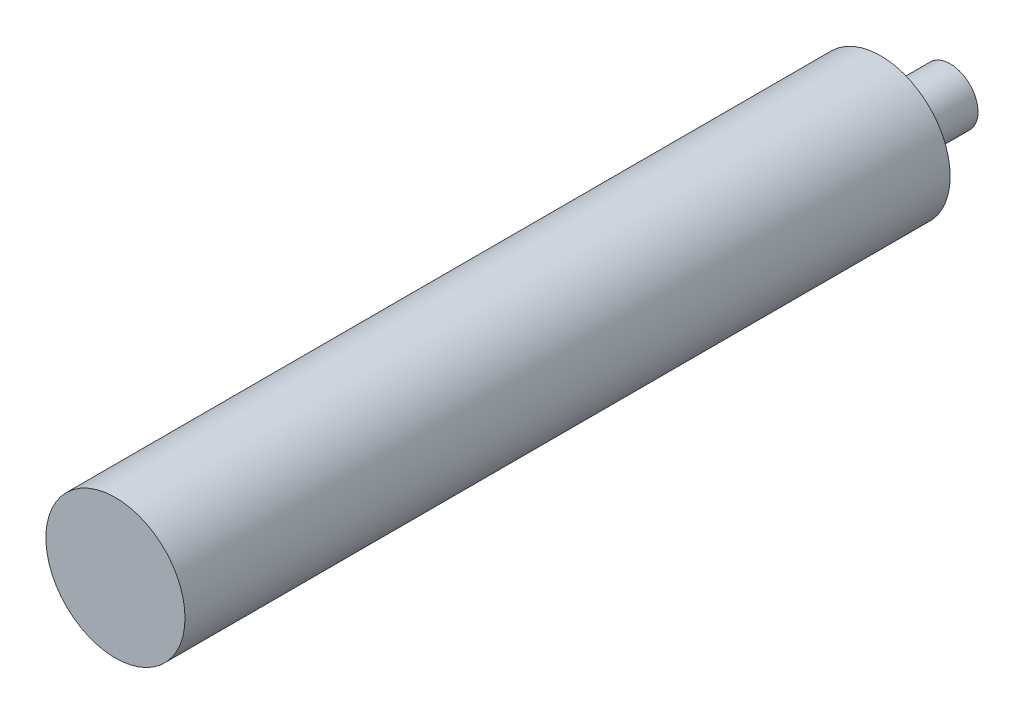
ISO-10303-21;
HEADER;
FILE_DESCRIPTION(('STEP AP214'),'2;1');
FILE_NAME('part.step','',(''),(''),'','','');
FILE_SCHEMA(('AUTOMOTIVE_DESIGN { 1 0 10303 214 1 1 1 1 }'));
ENDSEC;
DATA;
#1=APPLICATION_CONTEXT('core data for automotive mechanical design processes');
#2=APPLICATION_PROTOCOL_DEFINITION('international standard','automotive_design',2000,#1);
#3=PRODUCT_CONTEXT('',#1,'mechanical');
#4=PRODUCT('Part','Part','',(#3));
#5=PRODUCT_RELATED_PRODUCT_CATEGORY('part','',(#4));
#6=PRODUCT_DEFINITION_FORMATION('','',#4);
#7=PRODUCT_DEFINITION_CONTEXT('part definition',#1,'design');
#8=PRODUCT_DEFINITION('design','',#6,#7);
#9=PRODUCT_DEFINITION_SHAPE('','',#8);
#10=(LENGTH_UNIT() NAMED_UNIT(*) SI_UNIT(.MILLI.,.METRE.));
#11=(NAMED_UNIT(*) PLANE_ANGLE_UNIT() SI_UNIT($,.RADIAN.));
#12=(NAMED_UNIT(*) SI_UNIT($,.STERADIAN.) SOLID_ANGLE_UNIT());
#13=UNCERTAINTY_MEASURE_WITH_UNIT(LENGTH_MEASURE(1.E-05),#10,'distance_accuracy_value','');
#14=(GEOMETRIC_REPRESENTATION_CONTEXT(3) GLOBAL_UNCERTAINTY_ASSIGNED_CONTEXT((#13)) GLOBAL_UNIT_ASSIGNED_CONTEXT((#10,
#11,#12)) REPRESENTATION_CONTEXT('',''));
#15=CARTESIAN_POINT('',(0.,0.,0.));
#16=DIRECTION('',(0.,0.,1.));
#17=DIRECTION('',(1.,0.,0.));
#18=AXIS2_PLACEMENT_3D('',#15,#16,#17);
#19=CARTESIAN_POINT('',(0.,0.,5.));
#20=DIRECTION('',(0.,0.,-1.));
#21=DIRECTION('',(-1.,0.,0.));
#22=AXIS2_PLACEMENT_3D('',#19,#20,#21);
#23=CYLINDRICAL_SURFACE('',#22,2.);
#24=CARTESIAN_POINT('',(0.,0.,5.));
#25=DIRECTION('',(0.,0.,1.));
#26=DIRECTION('',(1.,0.,0.));
#27=AXIS2_PLACEMENT_3D('',#24,#25,#26);
#28=CIRCLE('',#27,2.);
#29=CARTESIAN_POINT('',(2.,0.,5.));
#30=VERTEX_POINT('',#29);
#31=EDGE_CURVE('E10',#30,#30,#28,.T.);
#32=ORIENTED_EDGE('',*,*,#31,.F.);
#33=EDGE_LOOP('',(#32));
#34=FACE_BOUND('',#33,.T.);
#35=CARTESIAN_POINT('',(0.,0.,0.));
#36=DIRECTION('',(0.,0.,1.));
#37=DIRECTION('',(1.,0.,0.));
#38=AXIS2_PLACEMENT_3D('',#35,#36,#37);
#39=CIRCLE('',#38,2.);
#40=CARTESIAN_POINT('',(2.,0.,0.));
#41=VERTEX_POINT('',#40);
#42=EDGE_CURVE('E33',#41,#41,#39,.T.);
#43=ORIENTED_EDGE('',*,*,#42,.T.);
#44=EDGE_LOOP('',(#43));
#45=FACE_BOUND('',#44,.T.);
#46=ADVANCED_FACE('F30',(#34,#45),#23,.T.);
#47=CARTESIAN_POINT('',(0.,0.,0.));
#48=DIRECTION('',(0.,0.,1.));
#49=DIRECTION('',(1.,0.,0.));
#50=AXIS2_PLACEMENT_3D('',#47,#48,#49);
#51=PLANE('',#50);
#52=ORIENTED_EDGE('',*,*,#42,.F.);
#53=EDGE_LOOP('',(#52));
#54=FACE_BOUND('',#53,.T.);
#55=ADVANCED_FACE('F58',(#54),#51,.F.);
#56=CARTESIAN_POINT('',(0.,0.,5.));
#57=DIRECTION('',(0.,0.,1.));
#58=DIRECTION('',(1.,0.,0.));
#59=AXIS2_PLACEMENT_3D('',#56,#57,#58);
#60=PLANE('',#59);
#61=CARTESIAN_POINT('',(0.,0.,5.));
#62=DIRECTION('',(0.,0.,1.));
#63=DIRECTION('',(1.,0.,0.));
#64=AXIS2_PLACEMENT_3D('',#61,#62,#63);
#65=CIRCLE('',#64,5.);
#66=CARTESIAN_POINT('',(5.,0.,5.));
#67=VERTEX_POINT('',#66);
#68=EDGE_CURVE('E42',#67,#67,#65,.T.);
#69=ORIENTED_EDGE('',*,*,#68,.F.);
#70=EDGE_LOOP('',(#69));
#71=FACE_BOUND('',#70,.T.);
#72=ORIENTED_EDGE('',*,*,#31,.T.);
#73=EDGE_LOOP('',(#72));
#74=FACE_BOUND('',#73,.T.);
#75=ADVANCED_FACE('F53',(#71,#74),#60,.F.);
#76=CARTESIAN_POINT('',(0.,0.,60.));
#77=DIRECTION('',(0.,0.,-1.));
#78=DIRECTION('',(-1.,0.,0.));
#79=AXIS2_PLACEMENT_3D('',#76,#77,#78);
#80=CYLINDRICAL_SURFACE('',#79,5.);
#81=CARTESIAN_POINT('',(0.,0.,60.));
#82=DIRECTION('',(0.,0.,1.));
#83=DIRECTION('',(1.,0.,0.));
#84=AXIS2_PLACEMENT_3D('',#81,#82,#83);
#85=CIRCLE('',#84,5.);
#86=CARTESIAN_POINT('',(5.,0.,60.));
#87=VERTEX_POINT('',#86);
#88=EDGE_CURVE('E40',#87,#87,#85,.T.);
#89=ORIENTED_EDGE('',*,*,#88,.F.);
#90=EDGE_LOOP('',(#89));
#91=FACE_BOUND('',#90,.T.);
#92=ORIENTED_EDGE('',*,*,#68,.T.);
#93=EDGE_LOOP('',(#92));
#94=FACE_BOUND('',#93,.T.);
#95=ADVANCED_FACE('F50',(#91,#94),#80,.T.);
#96=CARTESIAN_POINT('',(0.,0.,60.));
#97=DIRECTION('',(0.,0.,1.));
#98=DIRECTION('',(1.,0.,0.));
#99=AXIS2_PLACEMENT_3D('',#96,#97,#98);
#100=PLANE('',#99);
#101=ORIENTED_EDGE('',*,*,#88,.T.);
#102=EDGE_LOOP('',(#101));
#103=FACE_BOUND('',#102,.T.);
#104=ADVANCED_FACE('F48',(#103),#100,.T.);
#105=CLOSED_SHELL('',(#46,#55,#75,#95,#104));
#106=MANIFOLD_SOLID_BREP('B2',#105);
#107=ADVANCED_BREP_SHAPE_REPRESENTATION('',(#18,#106),#14);
#108=SHAPE_DEFINITION_REPRESENTATION(#9,#107);
ENDSEC;
END-ISO-10303-21;
